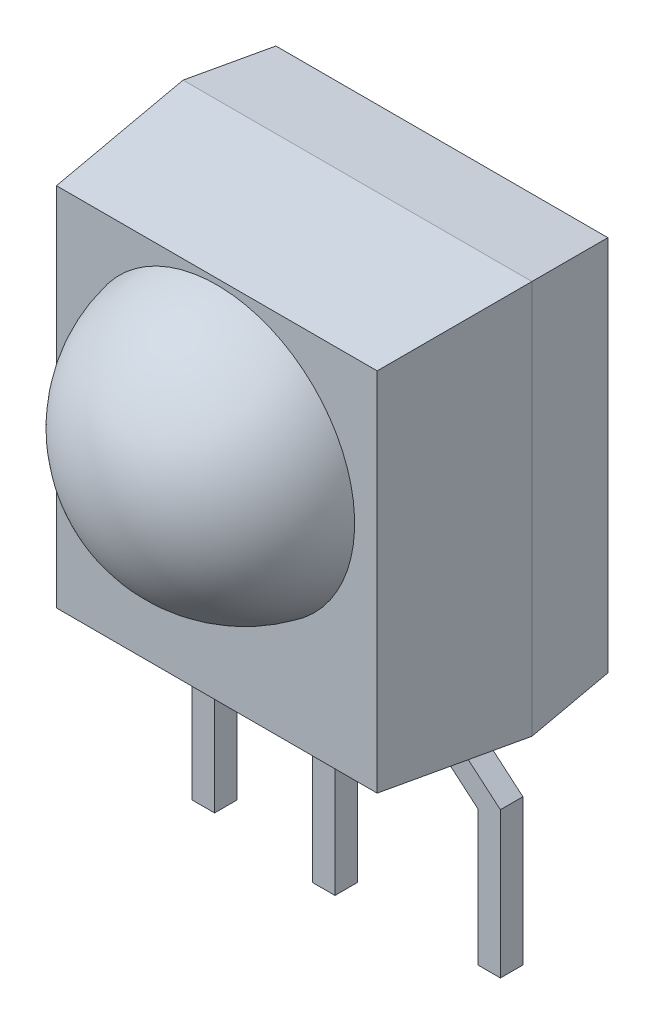
ISO-10303-21;
HEADER;
FILE_DESCRIPTION(('STEP AP214'),'2;1');
FILE_NAME('part.step','',(''),(''),'','','');
FILE_SCHEMA(('AUTOMOTIVE_DESIGN { 1 0 10303 214 1 1 1 1 }'));
ENDSEC;
DATA;
#1=APPLICATION_CONTEXT('core data for automotive mechanical design processes');
#2=APPLICATION_PROTOCOL_DEFINITION('international standard','automotive_design',2000,#1);
#3=PRODUCT_CONTEXT('',#1,'mechanical');
#4=PRODUCT('Part','Part','',(#3));
#5=PRODUCT_RELATED_PRODUCT_CATEGORY('part','',(#4));
#6=PRODUCT_DEFINITION_FORMATION('','',#4);
#7=PRODUCT_DEFINITION_CONTEXT('part definition',#1,'design');
#8=PRODUCT_DEFINITION('design','',#6,#7);
#9=PRODUCT_DEFINITION_SHAPE('','',#8);
#10=(LENGTH_UNIT() NAMED_UNIT(*) SI_UNIT(.MILLI.,.METRE.));
#11=(NAMED_UNIT(*) PLANE_ANGLE_UNIT() SI_UNIT($,.RADIAN.));
#12=(NAMED_UNIT(*) SI_UNIT($,.STERADIAN.) SOLID_ANGLE_UNIT());
#13=UNCERTAINTY_MEASURE_WITH_UNIT(LENGTH_MEASURE(1.E-05),#10,'distance_accuracy_value','');
#14=(GEOMETRIC_REPRESENTATION_CONTEXT(3) GLOBAL_UNCERTAINTY_ASSIGNED_CONTEXT((#13)) GLOBAL_UNIT_ASSIGNED_CONTEXT((#10,
#11,#12)) REPRESENTATION_CONTEXT('',''));
#15=CARTESIAN_POINT('',(0.,0.,0.));
#16=DIRECTION('',(0.,0.,1.));
#17=DIRECTION('',(1.,0.,0.));
#18=AXIS2_PLACEMENT_3D('',#15,#16,#17);
#19=CARTESIAN_POINT('',(-0.399999999999999,-3.5,0.4));
#20=DIRECTION('',(1.,0.,0.));
#21=DIRECTION('',(0.,1.,0.));
#22=AXIS2_PLACEMENT_3D('',#19,#20,#21);
#23=PLANE('',#22);
#24=DIRECTION('',(0.,-1.,0.));
#25=VECTOR('',#24,1.);
#26=CARTESIAN_POINT('',(-0.399999999999999,-3.5,0.));
#27=LINE('',#26,#25);
#28=CARTESIAN_POINT('',(-0.399999999999999,-3.5,0.));
#29=VERTEX_POINT('',#28);
#30=CARTESIAN_POINT('',(-0.399999999999999,-7.3,0.));
#31=VERTEX_POINT('',#30);
#32=EDGE_CURVE('E108',#29,#31,#27,.T.);
#33=ORIENTED_EDGE('',*,*,#32,.T.);
#34=DIRECTION('',(0.,0.,-1.));
#35=VECTOR('',#34,1.);
#36=CARTESIAN_POINT('',(-0.399999999999999,-7.3,0.4));
#37=LINE('',#36,#35);
#38=CARTESIAN_POINT('',(-0.399999999999999,-7.3,0.4));
#39=VERTEX_POINT('',#38);
#40=EDGE_CURVE('E12',#39,#31,#37,.T.);
#41=ORIENTED_EDGE('',*,*,#40,.F.);
#42=DIRECTION('',(0.,-1.,0.));
#43=VECTOR('',#42,1.);
#44=CARTESIAN_POINT('',(-0.399999999999999,-3.5,0.4));
#45=LINE('',#44,#43);
#46=CARTESIAN_POINT('',(-0.399999999999999,-3.5,0.4));
#47=VERTEX_POINT('',#46);
#48=EDGE_CURVE('E85',#47,#39,#45,.T.);
#49=ORIENTED_EDGE('',*,*,#48,.F.);
#50=DIRECTION('',(0.,0.,-1.));
#51=VECTOR('',#50,1.);
#52=CARTESIAN_POINT('',(-0.399999999999999,-3.5,0.4));
#53=LINE('',#52,#51);
#54=EDGE_CURVE('E61',#47,#29,#53,.T.);
#55=ORIENTED_EDGE('',*,*,#54,.T.);
#56=EDGE_LOOP('',(#33,#41,#49,#55));
#57=FACE_BOUND('',#56,.T.);
#58=ADVANCED_FACE('F45',(#57),#23,.F.);
#59=CARTESIAN_POINT('',(0.,-7.3,0.4));
#60=DIRECTION('',(0.,-1.,0.));
#61=DIRECTION('',(0.,0.,-1.));
#62=AXIS2_PLACEMENT_3D('',#59,#60,#61);
#63=PLANE('',#62);
#64=DIRECTION('',(-1.,0.,0.));
#65=VECTOR('',#64,1.);
#66=CARTESIAN_POINT('',(0.,-7.3,0.));
#67=LINE('',#66,#65);
#68=CARTESIAN_POINT('',(0.,-7.3,0.));
#69=VERTEX_POINT('',#68);
#70=EDGE_CURVE('E94',#69,#31,#67,.T.);
#71=ORIENTED_EDGE('',*,*,#70,.F.);
#72=DIRECTION('',(0.,0.,-1.));
#73=VECTOR('',#72,1.);
#74=CARTESIAN_POINT('',(0.,-7.3,0.4));
#75=LINE('',#74,#73);
#76=CARTESIAN_POINT('',(0.,-7.3,0.4));
#77=VERTEX_POINT('',#76);
#78=EDGE_CURVE('E53',#77,#69,#75,.T.);
#79=ORIENTED_EDGE('',*,*,#78,.F.);
#80=DIRECTION('',(-1.,0.,0.));
#81=VECTOR('',#80,1.);
#82=CARTESIAN_POINT('',(0.,-7.3,0.4));
#83=LINE('',#82,#81);
#84=EDGE_CURVE('E92',#77,#39,#83,.T.);
#85=ORIENTED_EDGE('',*,*,#84,.T.);
#86=ORIENTED_EDGE('',*,*,#40,.T.);
#87=EDGE_LOOP('',(#71,#79,#85,#86));
#88=FACE_BOUND('',#87,.T.);
#89=ADVANCED_FACE('F91',(#88),#63,.T.);
#90=CARTESIAN_POINT('',(0.,-3.5,0.4));
#91=DIRECTION('',(1.,0.,0.));
#92=DIRECTION('',(0.,1.,0.));
#93=AXIS2_PLACEMENT_3D('',#90,#91,#92);
#94=PLANE('',#93);
#95=DIRECTION('',(0.,-1.,0.));
#96=VECTOR('',#95,1.);
#97=CARTESIAN_POINT('',(0.,-3.5,0.));
#98=LINE('',#97,#96);
#99=CARTESIAN_POINT('',(0.,-3.5,0.));
#100=VERTEX_POINT('',#99);
#101=EDGE_CURVE('E111',#100,#69,#98,.T.);
#102=ORIENTED_EDGE('',*,*,#101,.F.);
#103=DIRECTION('',(0.,0.,-1.));
#104=VECTOR('',#103,1.);
#105=CARTESIAN_POINT('',(0.,-3.5,0.4));
#106=LINE('',#105,#104);
#107=CARTESIAN_POINT('',(0.,-3.5,0.4));
#108=VERTEX_POINT('',#107);
#109=EDGE_CURVE('E74',#108,#100,#106,.T.);
#110=ORIENTED_EDGE('',*,*,#109,.F.);
#111=DIRECTION('',(0.,-1.,0.));
#112=VECTOR('',#111,1.);
#113=CARTESIAN_POINT('',(0.,-3.5,0.4));
#114=LINE('',#113,#112);
#115=EDGE_CURVE('E100',#108,#77,#114,.T.);
#116=ORIENTED_EDGE('',*,*,#115,.T.);
#117=ORIENTED_EDGE('',*,*,#78,.T.);
#118=EDGE_LOOP('',(#102,#110,#116,#117));
#119=FACE_BOUND('',#118,.T.);
#120=ADVANCED_FACE('F102',(#119),#94,.T.);
#121=CARTESIAN_POINT('',(-0.399999999999999,-3.5,0.4));
#122=DIRECTION('',(0.,1.,0.));
#123=DIRECTION('',(0.,0.,1.));
#124=AXIS2_PLACEMENT_3D('',#121,#122,#123);
#125=PLANE('',#124);
#126=DIRECTION('',(1.,0.,0.));
#127=VECTOR('',#126,1.);
#128=CARTESIAN_POINT('',(-0.399999999999999,-3.5,0.));
#129=LINE('',#128,#127);
#130=EDGE_CURVE('E113',#29,#100,#129,.T.);
#131=ORIENTED_EDGE('',*,*,#130,.F.);
#132=ORIENTED_EDGE('',*,*,#54,.F.);
#133=DIRECTION('',(1.,0.,0.));
#134=VECTOR('',#133,1.);
#135=CARTESIAN_POINT('',(-0.399999999999999,-3.5,0.4));
#136=LINE('',#135,#134);
#137=EDGE_CURVE('E103',#47,#108,#136,.T.);
#138=ORIENTED_EDGE('',*,*,#137,.T.);
#139=ORIENTED_EDGE('',*,*,#109,.T.);
#140=EDGE_LOOP('',(#131,#132,#138,#139));
#141=FACE_BOUND('',#140,.T.);
#142=ADVANCED_FACE('F119',(#141),#125,.T.);
#143=CARTESIAN_POINT('',(0.,0.,0.4));
#144=DIRECTION('',(0.,0.,-1.));
#145=DIRECTION('',(-1.,0.,0.));
#146=AXIS2_PLACEMENT_3D('',#143,#144,#145);
#147=PLANE('',#146);
#148=ORIENTED_EDGE('',*,*,#48,.T.);
#149=ORIENTED_EDGE('',*,*,#84,.F.);
#150=ORIENTED_EDGE('',*,*,#115,.F.);
#151=ORIENTED_EDGE('',*,*,#137,.F.);
#152=EDGE_LOOP('',(#148,#149,#150,#151));
#153=FACE_BOUND('',#152,.T.);
#154=ADVANCED_FACE('F99',(#153),#147,.F.);
#155=CARTESIAN_POINT('',(0.,0.,0.));
#156=DIRECTION('',(0.,0.,-1.));
#157=DIRECTION('',(-1.,0.,0.));
#158=AXIS2_PLACEMENT_3D('',#155,#156,#157);
#159=PLANE('',#158);
#160=ORIENTED_EDGE('',*,*,#32,.F.);
#161=ORIENTED_EDGE('',*,*,#130,.T.);
#162=ORIENTED_EDGE('',*,*,#101,.T.);
#163=ORIENTED_EDGE('',*,*,#70,.T.);
#164=EDGE_LOOP('',(#160,#161,#162,#163));
#165=FACE_BOUND('',#164,.T.);
#166=ADVANCED_FACE('F118',(#165),#159,.T.);
#167=CLOSED_SHELL('',(#58,#89,#120,#142,#154,#166));
#168=MANIFOLD_SOLID_BREP('B2',#167);
#169=CARTESIAN_POINT('',(-2.34,-4.8026672029627,0.2));
#170=DIRECTION('',(-1.,0.,0.));
#171=DIRECTION('',(0.,1.,0.));
#172=AXIS2_PLACEMENT_3D('',#169,#170,#171);
#173=PLANE('',#172);
#174=DIRECTION('',(0.,-1.,0.));
#175=VECTOR('',#174,1.);
#176=CARTESIAN_POINT('',(-2.34,-4.8026672029627,-0.2));
#177=LINE('',#176,#175);
#178=CARTESIAN_POINT('',(-2.34,-4.89526217276128,-0.2));
#179=VERTEX_POINT('',#178);
#180=CARTESIAN_POINT('',(-2.34,-7.3,-0.2));
#181=VERTEX_POINT('',#180);
#182=EDGE_CURVE('E274',#179,#181,#177,.T.);
#183=ORIENTED_EDGE('',*,*,#182,.F.);
#184=DIRECTION('',(0.,0.,-1.));
#185=VECTOR('',#184,1.);
#186=CARTESIAN_POINT('',(-2.34,-4.89526217276128,0.2));
#187=LINE('',#186,#185);
#188=CARTESIAN_POINT('',(-2.34,-4.89526217276128,0.2));
#189=VERTEX_POINT('',#188);
#190=EDGE_CURVE('E273',#189,#179,#187,.T.);
#191=ORIENTED_EDGE('',*,*,#190,.F.);
#192=DIRECTION('',(0.,-1.,0.));
#193=VECTOR('',#192,1.);
#194=CARTESIAN_POINT('',(-2.34,-4.8026672029627,0.2));
#195=LINE('',#194,#193);
#196=CARTESIAN_POINT('',(-2.34,-7.3,0.2));
#197=VERTEX_POINT('',#196);
#198=EDGE_CURVE('E288',#189,#197,#195,.T.);
#199=ORIENTED_EDGE('',*,*,#198,.T.);
#200=DIRECTION('',(0.,0.,-1.));
#201=VECTOR('',#200,1.);
#202=CARTESIAN_POINT('',(-2.34,-7.3,0.2));
#203=LINE('',#202,#201);
#204=EDGE_CURVE('E43',#197,#181,#203,.T.);
#205=ORIENTED_EDGE('',*,*,#204,.T.);
#206=EDGE_LOOP('',(#183,#191,#199,#205));
#207=FACE_BOUND('',#206,.T.);
#208=ADVANCED_FACE('F178',(#207),#173,.F.);
#209=CARTESIAN_POINT('',(-2.74,-7.3,0.2));
#210=DIRECTION('',(0.,-1.,0.));
#211=DIRECTION('',(0.,0.,-1.));
#212=AXIS2_PLACEMENT_3D('',#209,#210,#211);
#213=PLANE('',#212);
#214=DIRECTION('',(1.,0.,0.));
#215=VECTOR('',#214,1.);
#216=CARTESIAN_POINT('',(-2.74,-7.3,-0.2));
#217=LINE('',#216,#215);
#218=CARTESIAN_POINT('',(-2.74,-7.3,-0.2));
#219=VERTEX_POINT('',#218);
#220=EDGE_CURVE('E276',#219,#181,#217,.T.);
#221=ORIENTED_EDGE('',*,*,#220,.T.);
#222=ORIENTED_EDGE('',*,*,#204,.F.);
#223=DIRECTION('',(1.,0.,0.));
#224=VECTOR('',#223,1.);
#225=CARTESIAN_POINT('',(-2.74,-7.3,0.2));
#226=LINE('',#225,#224);
#227=CARTESIAN_POINT('',(-2.74,-7.3,0.2));
#228=VERTEX_POINT('',#227);
#229=EDGE_CURVE('E232',#228,#197,#226,.T.);
#230=ORIENTED_EDGE('',*,*,#229,.F.);
#231=DIRECTION('',(0.,0.,-1.));
#232=VECTOR('',#231,1.);
#233=CARTESIAN_POINT('',(-2.74,-7.3,0.2));
#234=LINE('',#233,#232);
#235=EDGE_CURVE('E186',#228,#219,#234,.T.);
#236=ORIENTED_EDGE('',*,*,#235,.T.);
#237=EDGE_LOOP('',(#221,#222,#230,#236));
#238=FACE_BOUND('',#237,.T.);
#239=ADVANCED_FACE('F301',(#238),#213,.T.);
#240=CARTESIAN_POINT('',(-2.74,-4.8026672029627,0.2));
#241=DIRECTION('',(-1.,0.,0.));
#242=DIRECTION('',(0.,1.,0.));
#243=AXIS2_PLACEMENT_3D('',#240,#241,#242);
#244=PLANE('',#243);
#245=DIRECTION('',(0.,-1.,0.));
#246=VECTOR('',#245,1.);
#247=CARTESIAN_POINT('',(-2.74,-4.8026672029627,-0.2));
#248=LINE('',#247,#246);
#249=CARTESIAN_POINT('',(-2.74,-4.71007223316413,-0.2));
#250=VERTEX_POINT('',#249);
#251=EDGE_CURVE('E278',#250,#219,#248,.T.);
#252=ORIENTED_EDGE('',*,*,#251,.T.);
#253=ORIENTED_EDGE('',*,*,#235,.F.);
#254=DIRECTION('',(0.,-1.,0.));
#255=VECTOR('',#254,1.);
#256=CARTESIAN_POINT('',(-2.74,-4.8026672029627,0.2));
#257=LINE('',#256,#255);
#258=CARTESIAN_POINT('',(-2.74,-4.71007223316413,0.2));
#259=VERTEX_POINT('',#258);
#260=EDGE_CURVE('E312',#259,#228,#257,.T.);
#261=ORIENTED_EDGE('',*,*,#260,.F.);
#262=DIRECTION('',(0.,0.,-1.));
#263=VECTOR('',#262,1.);
#264=CARTESIAN_POINT('',(-2.74,-4.71007223316413,0.2));
#265=LINE('',#264,#263);
#266=EDGE_CURVE('E295',#259,#250,#265,.T.);
#267=ORIENTED_EDGE('',*,*,#266,.T.);
#268=EDGE_LOOP('',(#252,#253,#261,#267));
#269=FACE_BOUND('',#268,.T.);
#270=ADVANCED_FACE('F320',(#269),#244,.T.);
#271=CARTESIAN_POINT('',(-1.93421000880941,-4.02637163457817,0.2));
#272=DIRECTION('',(-0.646977448195095,0.762509135372792,0.));
#273=DIRECTION('',(0.762509135372792,0.646977448195095,0.));
#274=AXIS2_PLACEMENT_3D('',#271,#272,#273);
#275=PLANE('',#274);
#276=DIRECTION('',(-0.762509135372792,-0.646977448195095,0.));
#277=VECTOR('',#276,1.);
#278=CARTESIAN_POINT('',(-1.93421000880941,-4.02637163457817,-0.2));
#279=LINE('',#278,#277);
#280=CARTESIAN_POINT('',(-2.00481451917039,-4.08627849185416,-0.2));
#281=VERTEX_POINT('',#280);
#282=EDGE_CURVE('E280',#281,#250,#279,.T.);
#283=ORIENTED_EDGE('',*,*,#282,.T.);
#284=ORIENTED_EDGE('',*,*,#266,.F.);
#285=DIRECTION('',(-0.762509135372792,-0.646977448195095,0.));
#286=VECTOR('',#285,1.);
#287=CARTESIAN_POINT('',(-1.93421000880941,-4.02637163457817,0.2));
#288=LINE('',#287,#286);
#289=CARTESIAN_POINT('',(-2.00481451917039,-4.08627849185416,0.2));
#290=VERTEX_POINT('',#289);
#291=EDGE_CURVE('E268',#290,#259,#288,.T.);
#292=ORIENTED_EDGE('',*,*,#291,.F.);
#293=DIRECTION('',(0.,0.,-1.));
#294=VECTOR('',#293,1.);
#295=CARTESIAN_POINT('',(-2.00481451917039,-4.08627849185416,0.2));
#296=LINE('',#295,#294);
#297=EDGE_CURVE('E292',#290,#281,#296,.T.);
#298=ORIENTED_EDGE('',*,*,#297,.T.);
#299=EDGE_LOOP('',(#283,#284,#292,#298));
#300=FACE_BOUND('',#299,.T.);
#301=ADVANCED_FACE('F319',(#300),#275,.T.);
#302=CARTESIAN_POINT('',(-2.00481451917039,-3.5,0.2));
#303=DIRECTION('',(-1.,0.,0.));
#304=DIRECTION('',(0.,0.,-1.));
#305=AXIS2_PLACEMENT_3D('',#302,#303,#304);
#306=PLANE('',#305);
#307=DIRECTION('',(0.,1.,0.));
#308=VECTOR('',#307,1.);
#309=CARTESIAN_POINT('',(-2.00481451917039,-3.5,-0.2));
#310=LINE('',#309,#308);
#311=CARTESIAN_POINT('',(-2.00481451917039,-3.5,-0.2));
#312=VERTEX_POINT('',#311);
#313=EDGE_CURVE('E282',#312,#281,#310,.F.);
#314=ORIENTED_EDGE('',*,*,#313,.T.);
#315=ORIENTED_EDGE('',*,*,#297,.F.);
#316=DIRECTION('',(0.,1.,0.));
#317=VECTOR('',#316,1.);
#318=CARTESIAN_POINT('',(-2.00481451917039,-3.5,0.2));
#319=LINE('',#318,#317);
#320=CARTESIAN_POINT('',(-2.00481451917039,-3.5,0.2));
#321=VERTEX_POINT('',#320);
#322=EDGE_CURVE('E266',#321,#290,#319,.F.);
#323=ORIENTED_EDGE('',*,*,#322,.F.);
#324=DIRECTION('',(0.,0.,-1.));
#325=VECTOR('',#324,1.);
#326=CARTESIAN_POINT('',(-2.00481451917039,-3.5,0.2));
#327=LINE('',#326,#325);
#328=EDGE_CURVE('E260',#321,#312,#327,.T.);
#329=ORIENTED_EDGE('',*,*,#328,.T.);
#330=EDGE_LOOP('',(#314,#315,#323,#329));
#331=FACE_BOUND('',#330,.T.);
#332=ADVANCED_FACE('F327',(#331),#306,.T.);
#333=CARTESIAN_POINT('',(-1.60481451917039,-3.5,0.2));
#334=DIRECTION('',(0.,1.,0.));
#335=DIRECTION('',(0.,0.,1.));
#336=AXIS2_PLACEMENT_3D('',#333,#334,#335);
#337=PLANE('',#336);
#338=DIRECTION('',(-1.,0.,0.));
#339=VECTOR('',#338,1.);
#340=CARTESIAN_POINT('',(-1.60481451917039,-3.5,-0.2));
#341=LINE('',#340,#339);
#342=CARTESIAN_POINT('',(-1.60481451917039,-3.5,-0.2));
#343=VERTEX_POINT('',#342);
#344=EDGE_CURVE('E284',#343,#312,#341,.T.);
#345=ORIENTED_EDGE('',*,*,#344,.T.);
#346=ORIENTED_EDGE('',*,*,#328,.F.);
#347=DIRECTION('',(-1.,0.,0.));
#348=VECTOR('',#347,1.);
#349=CARTESIAN_POINT('',(-1.60481451917039,-3.5,0.2));
#350=LINE('',#349,#348);
#351=CARTESIAN_POINT('',(-1.60481451917039,-3.5,0.2));
#352=VERTEX_POINT('',#351);
#353=EDGE_CURVE('E250',#352,#321,#350,.T.);
#354=ORIENTED_EDGE('',*,*,#353,.F.);
#355=DIRECTION('',(0.,0.,-1.));
#356=VECTOR('',#355,1.);
#357=CARTESIAN_POINT('',(-1.60481451917039,-3.5,0.2));
#358=LINE('',#357,#356);
#359=EDGE_CURVE('E255',#352,#343,#358,.T.);
#360=ORIENTED_EDGE('',*,*,#359,.T.);
#361=EDGE_LOOP('',(#345,#346,#354,#360));
#362=FACE_BOUND('',#361,.T.);
#363=ADVANCED_FACE('F263',(#362),#337,.T.);
#364=CARTESIAN_POINT('',(-1.60481451917039,-3.5,0.2));
#365=DIRECTION('',(-1.,0.,0.));
#366=DIRECTION('',(0.,0.,-1.));
#367=AXIS2_PLACEMENT_3D('',#364,#365,#366);
#368=PLANE('',#367);
#369=DIRECTION('',(0.,1.,0.));
#370=VECTOR('',#369,1.);
#371=CARTESIAN_POINT('',(-1.60481451917039,-3.5,-0.2));
#372=LINE('',#371,#370);
#373=CARTESIAN_POINT('',(-1.60481451917039,-4.27146843145131,-0.2));
#374=VERTEX_POINT('',#373);
#375=EDGE_CURVE('E257',#343,#374,#372,.F.);
#376=ORIENTED_EDGE('',*,*,#375,.F.);
#377=ORIENTED_EDGE('',*,*,#359,.F.);
#378=DIRECTION('',(0.,1.,0.));
#379=VECTOR('',#378,1.);
#380=CARTESIAN_POINT('',(-1.60481451917039,-3.5,0.2));
#381=LINE('',#380,#379);
#382=CARTESIAN_POINT('',(-1.60481451917039,-4.27146843145131,0.2));
#383=VERTEX_POINT('',#382);
#384=EDGE_CURVE('E246',#352,#383,#381,.F.);
#385=ORIENTED_EDGE('',*,*,#384,.T.);
#386=DIRECTION('',(0.,0.,-1.));
#387=VECTOR('',#386,1.);
#388=CARTESIAN_POINT('',(-1.60481451917039,-4.27146843145131,0.2));
#389=LINE('',#388,#387);
#390=EDGE_CURVE('E261',#383,#374,#389,.T.);
#391=ORIENTED_EDGE('',*,*,#390,.T.);
#392=EDGE_LOOP('',(#376,#377,#385,#391));
#393=FACE_BOUND('',#392,.T.);
#394=ADVANCED_FACE('F256',(#393),#368,.F.);
#395=CARTESIAN_POINT('',(-1.67541902953137,-4.33137528872729,0.2));
#396=DIRECTION('',(-0.646977448195095,0.762509135372792,0.));
#397=DIRECTION('',(0.762509135372792,0.646977448195095,0.));
#398=AXIS2_PLACEMENT_3D('',#395,#396,#397);
#399=PLANE('',#398);
#400=DIRECTION('',(-0.762509135372792,-0.646977448195095,0.));
#401=VECTOR('',#400,1.);
#402=CARTESIAN_POINT('',(-1.67541902953137,-4.33137528872729,-0.2));
#403=LINE('',#402,#401);
#404=EDGE_CURVE('E220',#374,#179,#403,.T.);
#405=ORIENTED_EDGE('',*,*,#404,.F.);
#406=ORIENTED_EDGE('',*,*,#390,.F.);
#407=DIRECTION('',(-0.762509135372792,-0.646977448195095,0.));
#408=VECTOR('',#407,1.);
#409=CARTESIAN_POINT('',(-1.67541902953137,-4.33137528872729,0.2));
#410=LINE('',#409,#408);
#411=EDGE_CURVE('E194',#383,#189,#410,.T.);
#412=ORIENTED_EDGE('',*,*,#411,.T.);
#413=ORIENTED_EDGE('',*,*,#190,.T.);
#414=EDGE_LOOP('',(#405,#406,#412,#413));
#415=FACE_BOUND('',#414,.T.);
#416=ADVANCED_FACE('F372',(#415),#399,.F.);
#417=CARTESIAN_POINT('',(0.,0.,0.2));
#418=DIRECTION('',(0.,0.,-1.));
#419=DIRECTION('',(1.,0.,0.));
#420=AXIS2_PLACEMENT_3D('',#417,#418,#419);
#421=PLANE('',#420);
#422=ORIENTED_EDGE('',*,*,#198,.F.);
#423=ORIENTED_EDGE('',*,*,#411,.F.);
#424=ORIENTED_EDGE('',*,*,#384,.F.);
#425=ORIENTED_EDGE('',*,*,#353,.T.);
#426=ORIENTED_EDGE('',*,*,#322,.T.);
#427=ORIENTED_EDGE('',*,*,#291,.T.);
#428=ORIENTED_EDGE('',*,*,#260,.T.);
#429=ORIENTED_EDGE('',*,*,#229,.T.);
#430=EDGE_LOOP('',(#422,#423,#424,#425,#426,#427,#428,#429));
#431=FACE_BOUND('',#430,.T.);
#432=ADVANCED_FACE('F248',(#431),#421,.F.);
#433=CARTESIAN_POINT('',(0.,0.,-0.2));
#434=DIRECTION('',(0.,0.,-1.));
#435=DIRECTION('',(1.,0.,0.));
#436=AXIS2_PLACEMENT_3D('',#433,#434,#435);
#437=PLANE('',#436);
#438=ORIENTED_EDGE('',*,*,#182,.T.);
#439=ORIENTED_EDGE('',*,*,#220,.F.);
#440=ORIENTED_EDGE('',*,*,#251,.F.);
#441=ORIENTED_EDGE('',*,*,#282,.F.);
#442=ORIENTED_EDGE('',*,*,#313,.F.);
#443=ORIENTED_EDGE('',*,*,#344,.F.);
#444=ORIENTED_EDGE('',*,*,#375,.T.);
#445=ORIENTED_EDGE('',*,*,#404,.T.);
#446=EDGE_LOOP('',(#438,#439,#440,#441,#442,#443,#444,#445));
#447=FACE_BOUND('',#446,.T.);
#448=ADVANCED_FACE('F305',(#447),#437,.T.);
#449=CLOSED_SHELL('',(#208,#239,#270,#301,#332,#363,#394,#416,#432,#448));
#450=MANIFOLD_SOLID_BREP('B6',#449);
#451=CARTESIAN_POINT('',(2.34,-4.8026672029627,0.2));
#452=DIRECTION('',(1.,0.,0.));
#453=DIRECTION('',(0.,1.,0.));
#454=AXIS2_PLACEMENT_3D('',#451,#452,#453);
#455=PLANE('',#454);
#456=DIRECTION('',(0.,-1.,0.));
#457=VECTOR('',#456,1.);
#458=CARTESIAN_POINT('',(2.34,-4.8026672029627,-0.2));
#459=LINE('',#458,#457);
#460=CARTESIAN_POINT('',(2.34,-4.89526217276128,-0.2));
#461=VERTEX_POINT('',#460);
#462=CARTESIAN_POINT('',(2.34,-7.3,-0.2));
#463=VERTEX_POINT('',#462);
#464=EDGE_CURVE('E511',#461,#463,#459,.T.);
#465=ORIENTED_EDGE('',*,*,#464,.T.);
#466=DIRECTION('',(0.,0.,-1.));
#467=VECTOR('',#466,1.);
#468=CARTESIAN_POINT('',(2.34,-7.3,0.2));
#469=LINE('',#468,#467);
#470=CARTESIAN_POINT('',(2.34,-7.3,0.2));
#471=VERTEX_POINT('',#470);
#472=EDGE_CURVE('E176',#471,#463,#469,.T.);
#473=ORIENTED_EDGE('',*,*,#472,.F.);
#474=DIRECTION('',(0.,-1.,0.));
#475=VECTOR('',#474,1.);
#476=CARTESIAN_POINT('',(2.34,-4.8026672029627,0.2));
#477=LINE('',#476,#475);
#478=CARTESIAN_POINT('',(2.34,-4.89526217276128,0.2));
#479=VERTEX_POINT('',#478);
#480=EDGE_CURVE('E469',#479,#471,#477,.T.);
#481=ORIENTED_EDGE('',*,*,#480,.F.);
#482=DIRECTION('',(0.,0.,-1.));
#483=VECTOR('',#482,1.);
#484=CARTESIAN_POINT('',(2.34,-4.89526217276128,0.2));
#485=LINE('',#484,#483);
#486=EDGE_CURVE('E510',#479,#461,#485,.T.);
#487=ORIENTED_EDGE('',*,*,#486,.T.);
#488=EDGE_LOOP('',(#465,#473,#481,#487));
#489=FACE_BOUND('',#488,.T.);
#490=ADVANCED_FACE('F414',(#489),#455,.F.);
#491=CARTESIAN_POINT('',(2.74,-7.3,0.2));
#492=DIRECTION('',(0.,-1.,0.));
#493=DIRECTION('',(0.,0.,-1.));
#494=AXIS2_PLACEMENT_3D('',#491,#492,#493);
#495=PLANE('',#494);
#496=DIRECTION('',(-1.,0.,0.));
#497=VECTOR('',#496,1.);
#498=CARTESIAN_POINT('',(2.74,-7.3,-0.2));
#499=LINE('',#498,#497);
#500=CARTESIAN_POINT('',(2.74,-7.3,-0.2));
#501=VERTEX_POINT('',#500);
#502=EDGE_CURVE('E514',#501,#463,#499,.T.);
#503=ORIENTED_EDGE('',*,*,#502,.F.);
#504=DIRECTION('',(0.,0.,-1.));
#505=VECTOR('',#504,1.);
#506=CARTESIAN_POINT('',(2.74,-7.3,0.2));
#507=LINE('',#506,#505);
#508=CARTESIAN_POINT('',(2.74,-7.3,0.2));
#509=VERTEX_POINT('',#508);
#510=EDGE_CURVE('E422',#509,#501,#507,.T.);
#511=ORIENTED_EDGE('',*,*,#510,.F.);
#512=DIRECTION('',(-1.,0.,0.));
#513=VECTOR('',#512,1.);
#514=CARTESIAN_POINT('',(2.74,-7.3,0.2));
#515=LINE('',#514,#513);
#516=EDGE_CURVE('E553',#509,#471,#515,.T.);
#517=ORIENTED_EDGE('',*,*,#516,.T.);
#518=ORIENTED_EDGE('',*,*,#472,.T.);
#519=EDGE_LOOP('',(#503,#511,#517,#518));
#520=FACE_BOUND('',#519,.T.);
#521=ADVANCED_FACE('F544',(#520),#495,.T.);
#522=CARTESIAN_POINT('',(2.74,-4.8026672029627,0.2));
#523=DIRECTION('',(1.,0.,0.));
#524=DIRECTION('',(0.,1.,0.));
#525=AXIS2_PLACEMENT_3D('',#522,#523,#524);
#526=PLANE('',#525);
#527=DIRECTION('',(0.,-1.,0.));
#528=VECTOR('',#527,1.);
#529=CARTESIAN_POINT('',(2.74,-4.8026672029627,-0.2));
#530=LINE('',#529,#528);
#531=CARTESIAN_POINT('',(2.74,-4.71007223316413,-0.2));
#532=VERTEX_POINT('',#531);
#533=EDGE_CURVE('E517',#532,#501,#530,.T.);
#534=ORIENTED_EDGE('',*,*,#533,.F.);
#535=DIRECTION('',(0.,0.,-1.));
#536=VECTOR('',#535,1.);
#537=CARTESIAN_POINT('',(2.74,-4.71007223316413,0.2));
#538=LINE('',#537,#536);
#539=CARTESIAN_POINT('',(2.74,-4.71007223316413,0.2));
#540=VERTEX_POINT('',#539);
#541=EDGE_CURVE('E534',#540,#532,#538,.T.);
#542=ORIENTED_EDGE('',*,*,#541,.F.);
#543=DIRECTION('',(0.,-1.,0.));
#544=VECTOR('',#543,1.);
#545=CARTESIAN_POINT('',(2.74,-4.8026672029627,0.2));
#546=LINE('',#545,#544);
#547=EDGE_CURVE('E541',#540,#509,#546,.T.);
#548=ORIENTED_EDGE('',*,*,#547,.T.);
#549=ORIENTED_EDGE('',*,*,#510,.T.);
#550=EDGE_LOOP('',(#534,#542,#548,#549));
#551=FACE_BOUND('',#550,.T.);
#552=ADVANCED_FACE('F539',(#551),#526,.T.);
#553=CARTESIAN_POINT('',(1.93421000880941,-4.02637163457817,0.2));
#554=DIRECTION('',(0.646977448195095,0.762509135372792,0.));
#555=DIRECTION('',(-0.762509135372792,0.646977448195095,0.));
#556=AXIS2_PLACEMENT_3D('',#553,#554,#555);
#557=PLANE('',#556);
#558=DIRECTION('',(0.762509135372792,-0.646977448195095,0.));
#559=VECTOR('',#558,1.);
#560=CARTESIAN_POINT('',(1.93421000880941,-4.02637163457817,-0.2));
#561=LINE('',#560,#559);
#562=CARTESIAN_POINT('',(2.00481451917039,-4.08627849185416,-0.2));
#563=VERTEX_POINT('',#562);
#564=EDGE_CURVE('E520',#563,#532,#561,.T.);
#565=ORIENTED_EDGE('',*,*,#564,.F.);
#566=DIRECTION('',(0.,0.,-1.));
#567=VECTOR('',#566,1.);
#568=CARTESIAN_POINT('',(2.00481451917039,-4.08627849185416,0.2));
#569=LINE('',#568,#567);
#570=CARTESIAN_POINT('',(2.00481451917039,-4.08627849185416,0.2));
#571=VERTEX_POINT('',#570);
#572=EDGE_CURVE('E532',#571,#563,#569,.T.);
#573=ORIENTED_EDGE('',*,*,#572,.F.);
#574=DIRECTION('',(0.762509135372792,-0.646977448195095,0.));
#575=VECTOR('',#574,1.);
#576=CARTESIAN_POINT('',(1.93421000880941,-4.02637163457817,0.2));
#577=LINE('',#576,#575);
#578=EDGE_CURVE('E505',#571,#540,#577,.T.);
#579=ORIENTED_EDGE('',*,*,#578,.T.);
#580=ORIENTED_EDGE('',*,*,#541,.T.);
#581=EDGE_LOOP('',(#565,#573,#579,#580));
#582=FACE_BOUND('',#581,.T.);
#583=ADVANCED_FACE('F551',(#582),#557,.T.);
#584=CARTESIAN_POINT('',(2.00481451917039,-3.5,0.2));
#585=DIRECTION('',(1.,0.,0.));
#586=DIRECTION('',(0.,0.,-1.));
#587=AXIS2_PLACEMENT_3D('',#584,#585,#586);
#588=PLANE('',#587);
#589=DIRECTION('',(0.,1.,0.));
#590=VECTOR('',#589,1.);
#591=CARTESIAN_POINT('',(2.00481451917039,-3.5,-0.2));
#592=LINE('',#591,#590);
#593=CARTESIAN_POINT('',(2.00481451917039,-3.5,-0.2));
#594=VERTEX_POINT('',#593);
#595=EDGE_CURVE('E523',#594,#563,#592,.F.);
#596=ORIENTED_EDGE('',*,*,#595,.F.);
#597=DIRECTION('',(0.,0.,-1.));
#598=VECTOR('',#597,1.);
#599=CARTESIAN_POINT('',(2.00481451917039,-3.5,0.2));
#600=LINE('',#599,#598);
#601=CARTESIAN_POINT('',(2.00481451917039,-3.5,0.2));
#602=VERTEX_POINT('',#601);
#603=EDGE_CURVE('E493',#602,#594,#600,.T.);
#604=ORIENTED_EDGE('',*,*,#603,.F.);
#605=DIRECTION('',(0.,1.,0.));
#606=VECTOR('',#605,1.);
#607=CARTESIAN_POINT('',(2.00481451917039,-3.5,0.2));
#608=LINE('',#607,#606);
#609=EDGE_CURVE('E503',#602,#571,#608,.F.);
#610=ORIENTED_EDGE('',*,*,#609,.T.);
#611=ORIENTED_EDGE('',*,*,#572,.T.);
#612=EDGE_LOOP('',(#596,#604,#610,#611));
#613=FACE_BOUND('',#612,.T.);
#614=ADVANCED_FACE('F558',(#613),#588,.T.);
#615=CARTESIAN_POINT('',(1.60481451917039,-3.5,0.2));
#616=DIRECTION('',(0.,1.,0.));
#617=DIRECTION('',(0.,0.,1.));
#618=AXIS2_PLACEMENT_3D('',#615,#616,#617);
#619=PLANE('',#618);
#620=DIRECTION('',(1.,0.,0.));
#621=VECTOR('',#620,1.);
#622=CARTESIAN_POINT('',(1.60481451917039,-3.5,-0.2));
#623=LINE('',#622,#621);
#624=CARTESIAN_POINT('',(1.60481451917039,-3.5,-0.2));
#625=VERTEX_POINT('',#624);
#626=EDGE_CURVE('E492',#625,#594,#623,.T.);
#627=ORIENTED_EDGE('',*,*,#626,.F.);
#628=DIRECTION('',(0.,0.,-1.));
#629=VECTOR('',#628,1.);
#630=CARTESIAN_POINT('',(1.60481451917039,-3.5,0.2));
#631=LINE('',#630,#629);
#632=CARTESIAN_POINT('',(1.60481451917039,-3.5,0.2));
#633=VERTEX_POINT('',#632);
#634=EDGE_CURVE('E486',#633,#625,#631,.T.);
#635=ORIENTED_EDGE('',*,*,#634,.F.);
#636=DIRECTION('',(1.,0.,0.));
#637=VECTOR('',#636,1.);
#638=CARTESIAN_POINT('',(1.60481451917039,-3.5,0.2));
#639=LINE('',#638,#637);
#640=EDGE_CURVE('E490',#633,#602,#639,.T.);
#641=ORIENTED_EDGE('',*,*,#640,.T.);
#642=ORIENTED_EDGE('',*,*,#603,.T.);
#643=EDGE_LOOP('',(#627,#635,#641,#642));
#644=FACE_BOUND('',#643,.T.);
#645=ADVANCED_FACE('F488',(#644),#619,.T.);
#646=CARTESIAN_POINT('',(1.60481451917039,-3.5,0.2));
#647=DIRECTION('',(1.,0.,0.));
#648=DIRECTION('',(0.,0.,-1.));
#649=AXIS2_PLACEMENT_3D('',#646,#647,#648);
#650=PLANE('',#649);
#651=DIRECTION('',(0.,1.,0.));
#652=VECTOR('',#651,1.);
#653=CARTESIAN_POINT('',(1.60481451917039,-3.5,-0.2));
#654=LINE('',#653,#652);
#655=CARTESIAN_POINT('',(1.60481451917039,-4.27146843145131,-0.2));
#656=VERTEX_POINT('',#655);
#657=EDGE_CURVE('E457',#625,#656,#654,.F.);
#658=ORIENTED_EDGE('',*,*,#657,.T.);
#659=DIRECTION('',(0.,0.,-1.));
#660=VECTOR('',#659,1.);
#661=CARTESIAN_POINT('',(1.60481451917039,-4.27146843145131,0.2));
#662=LINE('',#661,#660);
#663=CARTESIAN_POINT('',(1.60481451917039,-4.27146843145131,0.2));
#664=VERTEX_POINT('',#663);
#665=EDGE_CURVE('E494',#664,#656,#662,.T.);
#666=ORIENTED_EDGE('',*,*,#665,.F.);
#667=DIRECTION('',(0.,1.,0.));
#668=VECTOR('',#667,1.);
#669=CARTESIAN_POINT('',(1.60481451917039,-3.5,0.2));
#670=LINE('',#669,#668);
#671=EDGE_CURVE('E496',#633,#664,#670,.F.);
#672=ORIENTED_EDGE('',*,*,#671,.F.);
#673=ORIENTED_EDGE('',*,*,#634,.T.);
#674=EDGE_LOOP('',(#658,#666,#672,#673));
#675=FACE_BOUND('',#674,.T.);
#676=ADVANCED_FACE('F497',(#675),#650,.F.);
#677=CARTESIAN_POINT('',(1.67541902953137,-4.33137528872729,0.2));
#678=DIRECTION('',(0.646977448195095,0.762509135372792,0.));
#679=DIRECTION('',(-0.762509135372792,0.646977448195095,0.));
#680=AXIS2_PLACEMENT_3D('',#677,#678,#679);
#681=PLANE('',#680);
#682=DIRECTION('',(0.762509135372792,-0.646977448195095,0.));
#683=VECTOR('',#682,1.);
#684=CARTESIAN_POINT('',(1.67541902953137,-4.33137528872729,-0.2));
#685=LINE('',#684,#683);
#686=EDGE_CURVE('E463',#656,#461,#685,.T.);
#687=ORIENTED_EDGE('',*,*,#686,.T.);
#688=ORIENTED_EDGE('',*,*,#486,.F.);
#689=DIRECTION('',(0.762509135372792,-0.646977448195095,0.));
#690=VECTOR('',#689,1.);
#691=CARTESIAN_POINT('',(1.67541902953137,-4.33137528872729,0.2));
#692=LINE('',#691,#690);
#693=EDGE_CURVE('E430',#664,#479,#692,.T.);
#694=ORIENTED_EDGE('',*,*,#693,.F.);
#695=ORIENTED_EDGE('',*,*,#665,.T.);
#696=EDGE_LOOP('',(#687,#688,#694,#695));
#697=FACE_BOUND('',#696,.T.);
#698=ADVANCED_FACE('F560',(#697),#681,.F.);
#699=CARTESIAN_POINT('',(0.,0.,0.2));
#700=DIRECTION('',(0.,0.,-1.));
#701=DIRECTION('',(-1.,0.,0.));
#702=AXIS2_PLACEMENT_3D('',#699,#700,#701);
#703=PLANE('',#702);
#704=ORIENTED_EDGE('',*,*,#480,.T.);
#705=ORIENTED_EDGE('',*,*,#516,.F.);
#706=ORIENTED_EDGE('',*,*,#547,.F.);
#707=ORIENTED_EDGE('',*,*,#578,.F.);
#708=ORIENTED_EDGE('',*,*,#609,.F.);
#709=ORIENTED_EDGE('',*,*,#640,.F.);
#710=ORIENTED_EDGE('',*,*,#671,.T.);
#711=ORIENTED_EDGE('',*,*,#693,.T.);
#712=EDGE_LOOP('',(#704,#705,#706,#707,#708,#709,#710,#711));
#713=FACE_BOUND('',#712,.T.);
#714=ADVANCED_FACE('F500',(#713),#703,.F.);
#715=CARTESIAN_POINT('',(0.,0.,-0.2));
#716=DIRECTION('',(0.,0.,-1.));
#717=DIRECTION('',(-1.,0.,0.));
#718=AXIS2_PLACEMENT_3D('',#715,#716,#717);
#719=PLANE('',#718);
#720=ORIENTED_EDGE('',*,*,#464,.F.);
#721=ORIENTED_EDGE('',*,*,#686,.F.);
#722=ORIENTED_EDGE('',*,*,#657,.F.);
#723=ORIENTED_EDGE('',*,*,#626,.T.);
#724=ORIENTED_EDGE('',*,*,#595,.T.);
#725=ORIENTED_EDGE('',*,*,#564,.T.);
#726=ORIENTED_EDGE('',*,*,#533,.T.);
#727=ORIENTED_EDGE('',*,*,#502,.T.);
#728=EDGE_LOOP('',(#720,#721,#722,#723,#724,#725,#726,#727));
#729=FACE_BOUND('',#728,.T.);
#730=ADVANCED_FACE('F547',(#729),#719,.T.);
#731=CLOSED_SHELL('',(#490,#521,#552,#583,#614,#645,#676,#698,#714,#730));
#732=MANIFOLD_SOLID_BREP('B37',#731);
#733=CARTESIAN_POINT('',(0.,0.,-1.5));
#734=DIRECTION('',(0.,0.,-1.));
#735=DIRECTION('',(-1.,0.,0.));
#736=AXIS2_PLACEMENT_3D('',#733,#734,#735);
#737=PLANE('',#736);
#738=DIRECTION('',(0.,1.,0.));
#739=VECTOR('',#738,1.);
#740=CARTESIAN_POINT('',(-2.95,0.,-1.5));
#741=LINE('',#740,#739);
#742=CARTESIAN_POINT('',(-2.95,-3.35,-1.5));
#743=VERTEX_POINT('',#742);
#744=CARTESIAN_POINT('',(-2.95,3.35,-1.5));
#745=VERTEX_POINT('',#744);
#746=EDGE_CURVE('E650',#743,#745,#741,.T.);
#747=ORIENTED_EDGE('',*,*,#746,.T.);
#748=DIRECTION('',(1.,0.,0.));
#749=VECTOR('',#748,1.);
#750=CARTESIAN_POINT('',(0.,3.35,-1.5));
#751=LINE('',#750,#749);
#752=CARTESIAN_POINT('',(2.95,3.35,-1.5));
#753=VERTEX_POINT('',#752);
#754=EDGE_CURVE('E412',#745,#753,#751,.T.);
#755=ORIENTED_EDGE('',*,*,#754,.T.);
#756=DIRECTION('',(0.,-1.,0.));
#757=VECTOR('',#756,1.);
#758=CARTESIAN_POINT('',(2.95,0.,-1.5));
#759=LINE('',#758,#757);
#760=CARTESIAN_POINT('',(2.95,-3.35,-1.5));
#761=VERTEX_POINT('',#760);
#762=EDGE_CURVE('E733',#753,#761,#759,.T.);
#763=ORIENTED_EDGE('',*,*,#762,.T.);
#764=DIRECTION('',(-1.,0.,0.));
#765=VECTOR('',#764,1.);
#766=CARTESIAN_POINT('',(0.,-3.35,-1.5));
#767=LINE('',#766,#765);
#768=EDGE_CURVE('E661',#761,#743,#767,.T.);
#769=ORIENTED_EDGE('',*,*,#768,.T.);
#770=EDGE_LOOP('',(#747,#755,#763,#769));
#771=FACE_BOUND('',#770,.T.);
#772=ADVANCED_FACE('F641',(#771),#737,.T.);
#773=CARTESIAN_POINT('',(0.,0.,2.5));
#774=DIRECTION('',(0.,0.,-1.));
#775=DIRECTION('',(-1.,0.,0.));
#776=AXIS2_PLACEMENT_3D('',#773,#774,#775);
#777=PLANE('',#776);
#778=CARTESIAN_POINT('',(0.,0.7,2.5));
#779=DIRECTION('',(0.,0.,-1.));
#780=DIRECTION('',(-1.,0.,0.));
#781=AXIS2_PLACEMENT_3D('',#778,#779,#780);
#782=CIRCLE('',#781,2.44948974278318);
#783=CARTESIAN_POINT('',(-2.44948974278318,0.7,2.5));
#784=VERTEX_POINT('',#783);
#785=EDGE_CURVE('E645',#784,#784,#782,.T.);
#786=ORIENTED_EDGE('',*,*,#785,.T.);
#787=EDGE_LOOP('',(#786));
#788=FACE_BOUND('',#787,.T.);
#789=DIRECTION('',(0.,-1.,0.));
#790=VECTOR('',#789,1.);
#791=CARTESIAN_POINT('',(-2.85,-3.5,2.5));
#792=LINE('',#791,#790);
#793=CARTESIAN_POINT('',(-2.85,3.25,2.5));
#794=VERTEX_POINT('',#793);
#795=CARTESIAN_POINT('',(-2.85,-3.25,2.5));
#796=VERTEX_POINT('',#795);
#797=EDGE_CURVE('E718',#794,#796,#792,.T.);
#798=ORIENTED_EDGE('',*,*,#797,.T.);
#799=DIRECTION('',(1.,0.,0.));
#800=VECTOR('',#799,1.);
#801=CARTESIAN_POINT('',(3.1,-3.25,2.5));
#802=LINE('',#801,#800);
#803=CARTESIAN_POINT('',(2.85,-3.25,2.5));
#804=VERTEX_POINT('',#803);
#805=EDGE_CURVE('E699',#796,#804,#802,.T.);
#806=ORIENTED_EDGE('',*,*,#805,.T.);
#807=DIRECTION('',(0.,1.,0.));
#808=VECTOR('',#807,1.);
#809=CARTESIAN_POINT('',(2.85,3.5,2.5));
#810=LINE('',#809,#808);
#811=CARTESIAN_POINT('',(2.85,3.25,2.5));
#812=VERTEX_POINT('',#811);
#813=EDGE_CURVE('E708',#804,#812,#810,.T.);
#814=ORIENTED_EDGE('',*,*,#813,.T.);
#815=DIRECTION('',(-1.,0.,0.));
#816=VECTOR('',#815,1.);
#817=CARTESIAN_POINT('',(-3.1,3.25,2.5));
#818=LINE('',#817,#816);
#819=EDGE_CURVE('E713',#812,#794,#818,.T.);
#820=ORIENTED_EDGE('',*,*,#819,.T.);
#821=EDGE_LOOP('',(#798,#806,#814,#820));
#822=FACE_BOUND('',#821,.T.);
#823=ADVANCED_FACE('F716',(#788,#822),#777,.F.);
#824=CARTESIAN_POINT('',(0.,3.25,2.5));
#825=DIRECTION('',(0.,0.995037190209989,0.0995037190209958));
#826=DIRECTION('',(1.,0.,0.));
#827=AXIS2_PLACEMENT_3D('',#824,#825,#826);
#828=PLANE('',#827);
#829=DIRECTION('',(-0.0990147542976643,-0.0990147542976643,0.990147542976675));
#830=VECTOR('',#829,1.);
#831=CARTESIAN_POINT('',(2.81813725490196,3.21813725490196,2.81862745098038));
#832=LINE('',#831,#830);
#833=CARTESIAN_POINT('',(3.1,3.5,0.));
#834=VERTEX_POINT('',#833);
#835=EDGE_CURVE('E710',#834,#812,#832,.T.);
#836=ORIENTED_EDGE('',*,*,#835,.F.);
#837=DIRECTION('',(1.,0.,0.));
#838=VECTOR('',#837,1.);
#839=CARTESIAN_POINT('',(3.1,3.5,0.));
#840=LINE('',#839,#838);
#841=CARTESIAN_POINT('',(-3.1,3.5,0.));
#842=VERTEX_POINT('',#841);
#843=EDGE_CURVE('E728',#842,#834,#840,.T.);
#844=ORIENTED_EDGE('',*,*,#843,.F.);
#845=DIRECTION('',(0.0990147542976643,-0.0990147542976643,0.990147542976675));
#846=VECTOR('',#845,1.);
#847=CARTESIAN_POINT('',(-2.82205882352941,3.22205882352941,2.77941176470587));
#848=LINE('',#847,#846);
#849=EDGE_CURVE('E714',#794,#842,#848,.F.);
#850=ORIENTED_EDGE('',*,*,#849,.F.);
#851=ORIENTED_EDGE('',*,*,#819,.F.);
#852=EDGE_LOOP('',(#836,#844,#850,#851));
#853=FACE_BOUND('',#852,.T.);
#854=ADVANCED_FACE('F766',(#853),#828,.T.);
#855=CARTESIAN_POINT('',(-2.85,0.,2.5));
#856=DIRECTION('',(-0.995037190209989,0.,0.0995037190209958));
#857=DIRECTION('',(0.,1.,0.));
#858=AXIS2_PLACEMENT_3D('',#855,#856,#857);
#859=PLANE('',#858);
#860=ORIENTED_EDGE('',*,*,#849,.T.);
#861=DIRECTION('',(0.,1.,0.));
#862=VECTOR('',#861,1.);
#863=CARTESIAN_POINT('',(-3.1,3.5,0.));
#864=LINE('',#863,#862);
#865=CARTESIAN_POINT('',(-3.1,-3.5,0.));
#866=VERTEX_POINT('',#865);
#867=EDGE_CURVE('E721',#866,#842,#864,.T.);
#868=ORIENTED_EDGE('',*,*,#867,.F.);
#869=DIRECTION('',(0.0990147542976643,0.0990147542976643,0.990147542976675));
#870=VECTOR('',#869,1.);
#871=CARTESIAN_POINT('',(-2.81813725490196,-3.21813725490196,2.81862745098038));
#872=LINE('',#871,#870);
#873=EDGE_CURVE('E704',#796,#866,#872,.F.);
#874=ORIENTED_EDGE('',*,*,#873,.F.);
#875=ORIENTED_EDGE('',*,*,#797,.F.);
#876=EDGE_LOOP('',(#860,#868,#874,#875));
#877=FACE_BOUND('',#876,.T.);
#878=ADVANCED_FACE('F775',(#877),#859,.T.);
#879=CARTESIAN_POINT('',(2.85,0.,2.5));
#880=DIRECTION('',(0.995037190209989,0.,0.0995037190209958));
#881=DIRECTION('',(0.,-1.,0.));
#882=AXIS2_PLACEMENT_3D('',#879,#880,#881);
#883=PLANE('',#882);
#884=ORIENTED_EDGE('',*,*,#835,.T.);
#885=ORIENTED_EDGE('',*,*,#813,.F.);
#886=DIRECTION('',(0.0990147542976643,-0.0990147542976643,-0.990147542976675));
#887=VECTOR('',#886,1.);
#888=CARTESIAN_POINT('',(2.81813725490196,-3.21813725490196,2.81862745098038));
#889=LINE('',#888,#887);
#890=CARTESIAN_POINT('',(3.1,-3.5,0.));
#891=VERTEX_POINT('',#890);
#892=EDGE_CURVE('E694',#891,#804,#889,.F.);
#893=ORIENTED_EDGE('',*,*,#892,.F.);
#894=DIRECTION('',(0.,-1.,0.));
#895=VECTOR('',#894,1.);
#896=CARTESIAN_POINT('',(3.1,-3.5,0.));
#897=LINE('',#896,#895);
#898=EDGE_CURVE('E731',#834,#891,#897,.T.);
#899=ORIENTED_EDGE('',*,*,#898,.F.);
#900=EDGE_LOOP('',(#884,#885,#893,#899));
#901=FACE_BOUND('',#900,.T.);
#902=ADVANCED_FACE('F709',(#901),#883,.T.);
#903=CARTESIAN_POINT('',(0.,-3.25,2.5));
#904=DIRECTION('',(0.,-0.995037190209989,0.0995037190209958));
#905=DIRECTION('',(-1.,0.,0.));
#906=AXIS2_PLACEMENT_3D('',#903,#904,#905);
#907=PLANE('',#906);
#908=ORIENTED_EDGE('',*,*,#873,.T.);
#909=DIRECTION('',(-1.,0.,0.));
#910=VECTOR('',#909,1.);
#911=CARTESIAN_POINT('',(-3.1,-3.5,0.));
#912=LINE('',#911,#910);
#913=EDGE_CURVE('E700',#891,#866,#912,.T.);
#914=ORIENTED_EDGE('',*,*,#913,.F.);
#915=ORIENTED_EDGE('',*,*,#892,.T.);
#916=ORIENTED_EDGE('',*,*,#805,.F.);
#917=EDGE_LOOP('',(#908,#914,#915,#916));
#918=FACE_BOUND('',#917,.T.);
#919=ADVANCED_FACE('F697',(#918),#907,.T.);
#920=CARTESIAN_POINT('',(-3.1,-3.5,0.));
#921=DIRECTION('',(0.,0.995037190209989,0.0995037190209955));
#922=DIRECTION('',(1.,0.,0.));
#923=AXIS2_PLACEMENT_3D('',#920,#921,#922);
#924=PLANE('',#923);
#925=DIRECTION('',(0.0990147542976641,0.0990147542976641,-0.990147542976675));
#926=VECTOR('',#925,1.);
#927=CARTESIAN_POINT('',(-3.1,-3.5,0.));
#928=LINE('',#927,#926);
#929=EDGE_CURVE('E746',#743,#866,#928,.F.);
#930=ORIENTED_EDGE('',*,*,#929,.F.);
#931=ORIENTED_EDGE('',*,*,#768,.F.);
#932=DIRECTION('',(-0.0990147542976641,0.0990147542976641,-0.990147542976675));
#933=VECTOR('',#932,1.);
#934=CARTESIAN_POINT('',(3.1,-3.5,0.));
#935=LINE('',#934,#933);
#936=EDGE_CURVE('E705',#891,#761,#935,.T.);
#937=ORIENTED_EDGE('',*,*,#936,.F.);
#938=ORIENTED_EDGE('',*,*,#913,.T.);
#939=EDGE_LOOP('',(#930,#931,#937,#938));
#940=FACE_BOUND('',#939,.T.);
#941=ADVANCED_FACE('F643',(#940),#924,.F.);
#942=CARTESIAN_POINT('',(3.1,-3.5,0.));
#943=DIRECTION('',(-0.995037190209989,0.,0.0995037190209955));
#944=DIRECTION('',(0.,1.,0.));
#945=AXIS2_PLACEMENT_3D('',#942,#943,#944);
#946=PLANE('',#945);
#947=ORIENTED_EDGE('',*,*,#936,.T.);
#948=ORIENTED_EDGE('',*,*,#762,.F.);
#949=DIRECTION('',(0.0990147542976641,0.0990147542976641,0.990147542976675));
#950=VECTOR('',#949,1.);
#951=CARTESIAN_POINT('',(3.03137254901961,3.43137254901961,-0.686274509803847));
#952=LINE('',#951,#950);
#953=EDGE_CURVE('E744',#834,#753,#952,.F.);
#954=ORIENTED_EDGE('',*,*,#953,.F.);
#955=ORIENTED_EDGE('',*,*,#898,.T.);
#956=EDGE_LOOP('',(#947,#948,#954,#955));
#957=FACE_BOUND('',#956,.T.);
#958=ADVANCED_FACE('F751',(#957),#946,.F.);
#959=CARTESIAN_POINT('',(-3.1,-3.5,0.));
#960=DIRECTION('',(0.995037190209989,0.,0.0995037190209955));
#961=DIRECTION('',(0.,-1.,0.));
#962=AXIS2_PLACEMENT_3D('',#959,#960,#961);
#963=PLANE('',#962);
#964=ORIENTED_EDGE('',*,*,#929,.T.);
#965=ORIENTED_EDGE('',*,*,#867,.T.);
#966=DIRECTION('',(0.0990147542976641,-0.0990147542976641,-0.990147542976675));
#967=VECTOR('',#966,1.);
#968=CARTESIAN_POINT('',(-3.03137254901961,3.43137254901961,-0.686274509803847));
#969=LINE('',#968,#967);
#970=EDGE_CURVE('E742',#745,#842,#969,.F.);
#971=ORIENTED_EDGE('',*,*,#970,.F.);
#972=ORIENTED_EDGE('',*,*,#746,.F.);
#973=EDGE_LOOP('',(#964,#965,#971,#972));
#974=FACE_BOUND('',#973,.T.);
#975=ADVANCED_FACE('F756',(#974),#963,.F.);
#976=CARTESIAN_POINT('',(-3.1,3.5,0.));
#977=DIRECTION('',(0.,-0.995037190209989,0.0995037190209955));
#978=DIRECTION('',(-1.,0.,0.));
#979=AXIS2_PLACEMENT_3D('',#976,#977,#978);
#980=PLANE('',#979);
#981=ORIENTED_EDGE('',*,*,#953,.T.);
#982=ORIENTED_EDGE('',*,*,#754,.F.);
#983=ORIENTED_EDGE('',*,*,#970,.T.);
#984=ORIENTED_EDGE('',*,*,#843,.T.);
#985=EDGE_LOOP('',(#981,#982,#983,#984));
#986=FACE_BOUND('',#985,.T.);
#987=ADVANCED_FACE('F760',(#986),#980,.F.);
#988=CARTESIAN_POINT('',(0.,0.7,2.));
#989=DIRECTION('',(0.,1.,0.));
#990=DIRECTION('',(0.,0.,-1.));
#991=AXIS2_PLACEMENT_3D('',#988,#989,#990);
#992=SPHERICAL_SURFACE('',#991,2.5);
#993=CARTESIAN_POINT('',(0.,0.7,2.));
#994=DIRECTION('',(0.,0.,-1.));
#995=DIRECTION('',(-1.,0.,0.));
#996=AXIS2_PLACEMENT_3D('',#993,#994,#995);
#997=SPHERICAL_SURFACE('',#996,2.5);
#998=ORIENTED_EDGE('',*,*,#785,.F.);
#999=EDGE_LOOP('',(#998));
#1000=FACE_BOUND('',#999,.T.);
#1001=ADVANCED_FACE('F784',(#1000),#997,.T.);
#1002=CLOSED_SHELL('',(#772,#823,#854,#878,#902,#919,#941,#958,#975,#987,#1001));
#1003=MANIFOLD_SOLID_BREP('B170',#1002);
#1004=ADVANCED_BREP_SHAPE_REPRESENTATION('',(#18,#168,#450,#732,#1003),#14);
#1005=SHAPE_DEFINITION_REPRESENTATION(#9,#1004);
ENDSEC;
END-ISO-10303-21;
